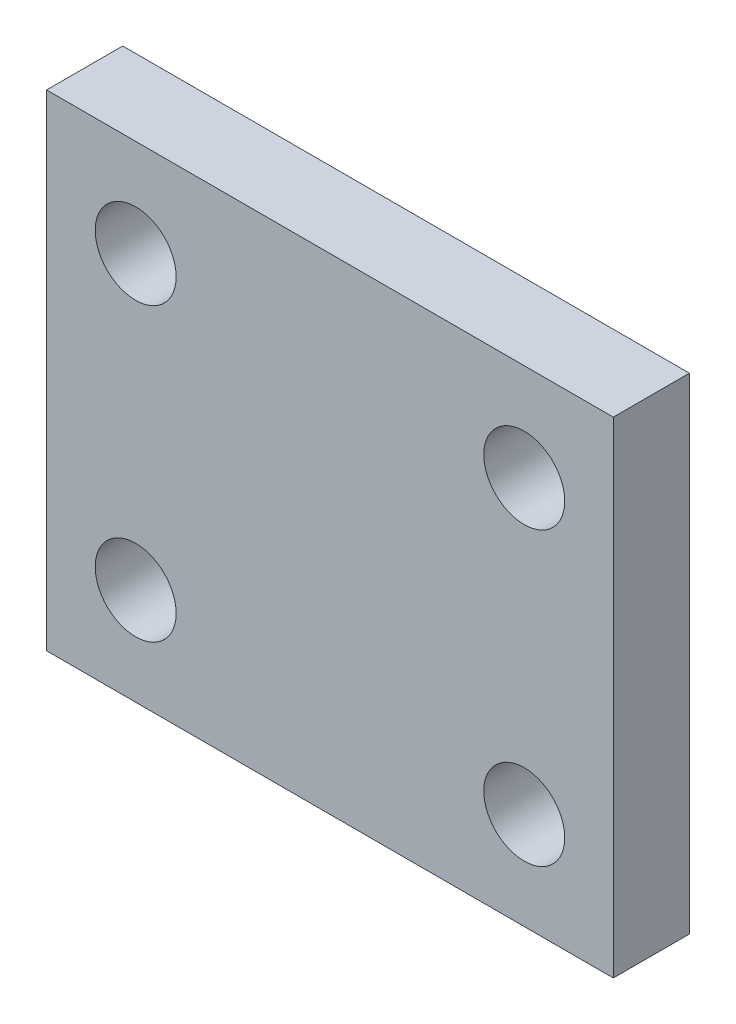
ISO-10303-21;
HEADER;
FILE_DESCRIPTION(('STEP AP214'),'2;1');
FILE_NAME('part.step','',(''),(''),'','','');
FILE_SCHEMA(('AUTOMOTIVE_DESIGN { 1 0 10303 214 1 1 1 1 }'));
ENDSEC;
DATA;
#1=APPLICATION_CONTEXT('core data for automotive mechanical design processes');
#2=APPLICATION_PROTOCOL_DEFINITION('international standard','automotive_design',2000,#1);
#3=PRODUCT_CONTEXT('',#1,'mechanical');
#4=PRODUCT('Part','Part','',(#3));
#5=PRODUCT_RELATED_PRODUCT_CATEGORY('part','',(#4));
#6=PRODUCT_DEFINITION_FORMATION('','',#4);
#7=PRODUCT_DEFINITION_CONTEXT('part definition',#1,'design');
#8=PRODUCT_DEFINITION('design','',#6,#7);
#9=PRODUCT_DEFINITION_SHAPE('','',#8);
#10=(LENGTH_UNIT() NAMED_UNIT(*) SI_UNIT(.MILLI.,.METRE.));
#11=(NAMED_UNIT(*) PLANE_ANGLE_UNIT() SI_UNIT($,.RADIAN.));
#12=(NAMED_UNIT(*) SI_UNIT($,.STERADIAN.) SOLID_ANGLE_UNIT());
#13=UNCERTAINTY_MEASURE_WITH_UNIT(LENGTH_MEASURE(1.E-05),#10,'distance_accuracy_value','');
#14=(GEOMETRIC_REPRESENTATION_CONTEXT(3) GLOBAL_UNCERTAINTY_ASSIGNED_CONTEXT((#13)) GLOBAL_UNIT_ASSIGNED_CONTEXT((#10,
#11,#12)) REPRESENTATION_CONTEXT('',''));
#15=CARTESIAN_POINT('',(0.,0.,0.));
#16=DIRECTION('',(0.,0.,1.));
#17=DIRECTION('',(1.,0.,0.));
#18=AXIS2_PLACEMENT_3D('',#15,#16,#17);
#19=CARTESIAN_POINT('',(0.,0.,4.7));
#20=DIRECTION('',(0.,0.,-1.));
#21=DIRECTION('',(-1.,0.,0.));
#22=AXIS2_PLACEMENT_3D('',#19,#20,#21);
#23=PLANE('',#22);
#24=DIRECTION('',(0.,-1.,0.));
#25=VECTOR('',#24,1.);
#26=CARTESIAN_POINT('',(0.,0.,4.7));
#27=LINE('',#26,#25);
#28=CARTESIAN_POINT('',(0.,30.,4.7));
#29=VERTEX_POINT('',#28);
#30=CARTESIAN_POINT('',(0.,0.,4.7));
#31=VERTEX_POINT('',#30);
#32=EDGE_CURVE('E94',#29,#31,#27,.T.);
#33=ORIENTED_EDGE('',*,*,#32,.T.);
#34=DIRECTION('',(1.,0.,0.));
#35=VECTOR('',#34,1.);
#36=CARTESIAN_POINT('',(0.,0.,4.7));
#37=LINE('',#36,#35);
#38=CARTESIAN_POINT('',(35.,0.,4.7));
#39=VERTEX_POINT('',#38);
#40=EDGE_CURVE('E89',#31,#39,#37,.T.);
#41=ORIENTED_EDGE('',*,*,#40,.T.);
#42=DIRECTION('',(0.,1.,0.));
#43=VECTOR('',#42,1.);
#44=CARTESIAN_POINT('',(35.,0.,4.7));
#45=LINE('',#44,#43);
#46=CARTESIAN_POINT('',(35.,30.,4.7));
#47=VERTEX_POINT('',#46);
#48=EDGE_CURVE('E92',#39,#47,#45,.T.);
#49=ORIENTED_EDGE('',*,*,#48,.T.);
#50=DIRECTION('',(-1.,0.,0.));
#51=VECTOR('',#50,1.);
#52=CARTESIAN_POINT('',(0.,30.,4.7));
#53=LINE('',#52,#51);
#54=EDGE_CURVE('E59',#47,#29,#53,.T.);
#55=ORIENTED_EDGE('',*,*,#54,.T.);
#56=EDGE_LOOP('',(#33,#41,#49,#55));
#57=FACE_BOUND('',#56,.T.);
#58=CARTESIAN_POINT('',(5.5,24.,4.7));
#59=DIRECTION('',(0.,0.,1.));
#60=DIRECTION('',(1.,0.,0.));
#61=AXIS2_PLACEMENT_3D('',#58,#59,#60);
#62=CIRCLE('',#61,2.5);
#63=CARTESIAN_POINT('',(8.,24.,4.7));
#64=VERTEX_POINT('',#63);
#65=EDGE_CURVE('E114',#64,#64,#62,.T.);
#66=ORIENTED_EDGE('',*,*,#65,.F.);
#67=EDGE_LOOP('',(#66));
#68=FACE_BOUND('',#67,.T.);
#69=CARTESIAN_POINT('',(29.5,24.,4.7));
#70=DIRECTION('',(0.,0.,1.));
#71=DIRECTION('',(1.,0.,0.));
#72=AXIS2_PLACEMENT_3D('',#69,#70,#71);
#73=CIRCLE('',#72,2.5);
#74=CARTESIAN_POINT('',(32.,24.,4.7));
#75=VERTEX_POINT('',#74);
#76=EDGE_CURVE('E136',#75,#75,#73,.T.);
#77=ORIENTED_EDGE('',*,*,#76,.F.);
#78=EDGE_LOOP('',(#77));
#79=FACE_BOUND('',#78,.T.);
#80=CARTESIAN_POINT('',(5.5,6.,4.7));
#81=DIRECTION('',(0.,0.,1.));
#82=DIRECTION('',(1.,0.,0.));
#83=AXIS2_PLACEMENT_3D('',#80,#81,#82);
#84=CIRCLE('',#83,2.5);
#85=CARTESIAN_POINT('',(8.,6.,4.7));
#86=VERTEX_POINT('',#85);
#87=EDGE_CURVE('E144',#86,#86,#84,.T.);
#88=ORIENTED_EDGE('',*,*,#87,.F.);
#89=EDGE_LOOP('',(#88));
#90=FACE_BOUND('',#89,.T.);
#91=CARTESIAN_POINT('',(29.5,6.,4.7));
#92=DIRECTION('',(0.,0.,1.));
#93=DIRECTION('',(1.,0.,0.));
#94=AXIS2_PLACEMENT_3D('',#91,#92,#93);
#95=CIRCLE('',#94,2.5);
#96=CARTESIAN_POINT('',(32.,6.,4.7));
#97=VERTEX_POINT('',#96);
#98=EDGE_CURVE('E152',#97,#97,#95,.T.);
#99=ORIENTED_EDGE('',*,*,#98,.F.);
#100=EDGE_LOOP('',(#99));
#101=FACE_BOUND('',#100,.T.);
#102=ADVANCED_FACE('F41',(#57,#68,#79,#90,#101),#23,.F.);
#103=CARTESIAN_POINT('',(0.,0.,0.));
#104=DIRECTION('',(0.,0.,-1.));
#105=DIRECTION('',(-1.,0.,0.));
#106=AXIS2_PLACEMENT_3D('',#103,#104,#105);
#107=PLANE('',#106);
#108=CARTESIAN_POINT('',(5.5,6.,0.));
#109=DIRECTION('',(0.,0.,1.));
#110=DIRECTION('',(1.,0.,0.));
#111=AXIS2_PLACEMENT_3D('',#108,#109,#110);
#112=CIRCLE('',#111,2.5);
#113=CARTESIAN_POINT('',(8.,6.,0.));
#114=VERTEX_POINT('',#113);
#115=EDGE_CURVE('E148',#114,#114,#112,.T.);
#116=ORIENTED_EDGE('',*,*,#115,.T.);
#117=EDGE_LOOP('',(#116));
#118=FACE_BOUND('',#117,.T.);
#119=CARTESIAN_POINT('',(5.5,24.,0.));
#120=DIRECTION('',(0.,0.,1.));
#121=DIRECTION('',(1.,0.,0.));
#122=AXIS2_PLACEMENT_3D('',#119,#120,#121);
#123=CIRCLE('',#122,2.5);
#124=CARTESIAN_POINT('',(8.,24.,0.));
#125=VERTEX_POINT('',#124);
#126=EDGE_CURVE('E132',#125,#125,#123,.T.);
#127=ORIENTED_EDGE('',*,*,#126,.T.);
#128=EDGE_LOOP('',(#127));
#129=FACE_BOUND('',#128,.T.);
#130=DIRECTION('',(0.,-1.,0.));
#131=VECTOR('',#130,1.);
#132=CARTESIAN_POINT('',(0.,0.,0.));
#133=LINE('',#132,#131);
#134=CARTESIAN_POINT('',(0.,30.,0.));
#135=VERTEX_POINT('',#134);
#136=CARTESIAN_POINT('',(0.,0.,0.));
#137=VERTEX_POINT('',#136);
#138=EDGE_CURVE('E110',#135,#137,#133,.T.);
#139=ORIENTED_EDGE('',*,*,#138,.F.);
#140=DIRECTION('',(-1.,0.,0.));
#141=VECTOR('',#140,1.);
#142=CARTESIAN_POINT('',(0.,30.,0.));
#143=LINE('',#142,#141);
#144=CARTESIAN_POINT('',(35.,30.,0.));
#145=VERTEX_POINT('',#144);
#146=EDGE_CURVE('E82',#145,#135,#143,.T.);
#147=ORIENTED_EDGE('',*,*,#146,.F.);
#148=DIRECTION('',(0.,1.,0.));
#149=VECTOR('',#148,1.);
#150=CARTESIAN_POINT('',(35.,0.,0.));
#151=LINE('',#150,#149);
#152=CARTESIAN_POINT('',(35.,0.,0.));
#153=VERTEX_POINT('',#152);
#154=EDGE_CURVE('E76',#153,#145,#151,.T.);
#155=ORIENTED_EDGE('',*,*,#154,.F.);
#156=DIRECTION('',(1.,0.,0.));
#157=VECTOR('',#156,1.);
#158=CARTESIAN_POINT('',(0.,0.,0.));
#159=LINE('',#158,#157);
#160=EDGE_CURVE('E99',#137,#153,#159,.T.);
#161=ORIENTED_EDGE('',*,*,#160,.F.);
#162=EDGE_LOOP('',(#139,#147,#155,#161));
#163=FACE_BOUND('',#162,.T.);
#164=CARTESIAN_POINT('',(29.5,24.,0.));
#165=DIRECTION('',(0.,0.,1.));
#166=DIRECTION('',(1.,0.,0.));
#167=AXIS2_PLACEMENT_3D('',#164,#165,#166);
#168=CIRCLE('',#167,2.5);
#169=CARTESIAN_POINT('',(32.,24.,0.));
#170=VERTEX_POINT('',#169);
#171=EDGE_CURVE('E140',#170,#170,#168,.T.);
#172=ORIENTED_EDGE('',*,*,#171,.T.);
#173=EDGE_LOOP('',(#172));
#174=FACE_BOUND('',#173,.T.);
#175=CARTESIAN_POINT('',(29.5,6.,0.));
#176=DIRECTION('',(0.,0.,1.));
#177=DIRECTION('',(1.,0.,0.));
#178=AXIS2_PLACEMENT_3D('',#175,#176,#177);
#179=CIRCLE('',#178,2.5);
#180=CARTESIAN_POINT('',(32.,6.,0.));
#181=VERTEX_POINT('',#180);
#182=EDGE_CURVE('E156',#181,#181,#179,.T.);
#183=ORIENTED_EDGE('',*,*,#182,.T.);
#184=EDGE_LOOP('',(#183));
#185=FACE_BOUND('',#184,.T.);
#186=ADVANCED_FACE('F127',(#118,#129,#163,#174,#185),#107,.T.);
#187=CARTESIAN_POINT('',(0.,0.,4.7));
#188=DIRECTION('',(1.,0.,0.));
#189=DIRECTION('',(0.,0.,-1.));
#190=AXIS2_PLACEMENT_3D('',#187,#188,#189);
#191=PLANE('',#190);
#192=ORIENTED_EDGE('',*,*,#138,.T.);
#193=DIRECTION('',(0.,0.,-1.));
#194=VECTOR('',#193,1.);
#195=CARTESIAN_POINT('',(0.,0.,4.7));
#196=LINE('',#195,#194);
#197=EDGE_CURVE('E11',#31,#137,#196,.T.);
#198=ORIENTED_EDGE('',*,*,#197,.F.);
#199=ORIENTED_EDGE('',*,*,#32,.F.);
#200=DIRECTION('',(0.,0.,-1.));
#201=VECTOR('',#200,1.);
#202=CARTESIAN_POINT('',(0.,30.,4.7));
#203=LINE('',#202,#201);
#204=EDGE_CURVE('E106',#29,#135,#203,.T.);
#205=ORIENTED_EDGE('',*,*,#204,.T.);
#206=EDGE_LOOP('',(#192,#198,#199,#205));
#207=FACE_BOUND('',#206,.T.);
#208=ADVANCED_FACE('F43',(#207),#191,.F.);
#209=CARTESIAN_POINT('',(0.,0.,4.7));
#210=DIRECTION('',(0.,1.,0.));
#211=DIRECTION('',(0.,0.,1.));
#212=AXIS2_PLACEMENT_3D('',#209,#210,#211);
#213=PLANE('',#212);
#214=ORIENTED_EDGE('',*,*,#160,.T.);
#215=DIRECTION('',(0.,0.,-1.));
#216=VECTOR('',#215,1.);
#217=CARTESIAN_POINT('',(35.,0.,4.7));
#218=LINE('',#217,#216);
#219=EDGE_CURVE('E51',#39,#153,#218,.T.);
#220=ORIENTED_EDGE('',*,*,#219,.F.);
#221=ORIENTED_EDGE('',*,*,#40,.F.);
#222=ORIENTED_EDGE('',*,*,#197,.T.);
#223=EDGE_LOOP('',(#214,#220,#221,#222));
#224=FACE_BOUND('',#223,.T.);
#225=ADVANCED_FACE('F98',(#224),#213,.F.);
#226=CARTESIAN_POINT('',(35.,0.,4.7));
#227=DIRECTION('',(-1.,0.,0.));
#228=DIRECTION('',(0.,0.,1.));
#229=AXIS2_PLACEMENT_3D('',#226,#227,#228);
#230=PLANE('',#229);
#231=ORIENTED_EDGE('',*,*,#154,.T.);
#232=DIRECTION('',(0.,0.,-1.));
#233=VECTOR('',#232,1.);
#234=CARTESIAN_POINT('',(35.,30.,4.7));
#235=LINE('',#234,#233);
#236=EDGE_CURVE('E101',#47,#145,#235,.T.);
#237=ORIENTED_EDGE('',*,*,#236,.F.);
#238=ORIENTED_EDGE('',*,*,#48,.F.);
#239=ORIENTED_EDGE('',*,*,#219,.T.);
#240=EDGE_LOOP('',(#231,#237,#238,#239));
#241=FACE_BOUND('',#240,.T.);
#242=ADVANCED_FACE('F102',(#241),#230,.F.);
#243=CARTESIAN_POINT('',(0.,30.,4.7));
#244=DIRECTION('',(0.,-1.,0.));
#245=DIRECTION('',(0.,0.,-1.));
#246=AXIS2_PLACEMENT_3D('',#243,#244,#245);
#247=PLANE('',#246);
#248=ORIENTED_EDGE('',*,*,#146,.T.);
#249=ORIENTED_EDGE('',*,*,#204,.F.);
#250=ORIENTED_EDGE('',*,*,#54,.F.);
#251=ORIENTED_EDGE('',*,*,#236,.T.);
#252=EDGE_LOOP('',(#248,#249,#250,#251));
#253=FACE_BOUND('',#252,.T.);
#254=ADVANCED_FACE('F124',(#253),#247,.F.);
#255=CARTESIAN_POINT('',(5.5,24.,4.7));
#256=DIRECTION('',(0.,0.,-1.));
#257=DIRECTION('',(-1.,0.,0.));
#258=AXIS2_PLACEMENT_3D('',#255,#256,#257);
#259=CYLINDRICAL_SURFACE('',#258,2.5);
#260=ORIENTED_EDGE('',*,*,#65,.T.);
#261=EDGE_LOOP('',(#260));
#262=FACE_BOUND('',#261,.T.);
#263=ORIENTED_EDGE('',*,*,#126,.F.);
#264=EDGE_LOOP('',(#263));
#265=FACE_BOUND('',#264,.T.);
#266=ADVANCED_FACE('F175',(#262,#265),#259,.F.);
#267=CARTESIAN_POINT('',(29.5,24.,4.7));
#268=DIRECTION('',(0.,0.,-1.));
#269=DIRECTION('',(-1.,0.,0.));
#270=AXIS2_PLACEMENT_3D('',#267,#268,#269);
#271=CYLINDRICAL_SURFACE('',#270,2.5);
#272=ORIENTED_EDGE('',*,*,#76,.T.);
#273=EDGE_LOOP('',(#272));
#274=FACE_BOUND('',#273,.T.);
#275=ORIENTED_EDGE('',*,*,#171,.F.);
#276=EDGE_LOOP('',(#275));
#277=FACE_BOUND('',#276,.T.);
#278=ADVANCED_FACE('F221',(#274,#277),#271,.F.);
#279=CARTESIAN_POINT('',(5.5,6.,4.7));
#280=DIRECTION('',(0.,0.,-1.));
#281=DIRECTION('',(-1.,0.,0.));
#282=AXIS2_PLACEMENT_3D('',#279,#280,#281);
#283=CYLINDRICAL_SURFACE('',#282,2.5);
#284=ORIENTED_EDGE('',*,*,#87,.T.);
#285=EDGE_LOOP('',(#284));
#286=FACE_BOUND('',#285,.T.);
#287=ORIENTED_EDGE('',*,*,#115,.F.);
#288=EDGE_LOOP('',(#287));
#289=FACE_BOUND('',#288,.T.);
#290=ADVANCED_FACE('F229',(#286,#289),#283,.F.);
#291=CARTESIAN_POINT('',(29.5,6.,4.7));
#292=DIRECTION('',(0.,0.,-1.));
#293=DIRECTION('',(-1.,0.,0.));
#294=AXIS2_PLACEMENT_3D('',#291,#292,#293);
#295=CYLINDRICAL_SURFACE('',#294,2.5);
#296=ORIENTED_EDGE('',*,*,#98,.T.);
#297=EDGE_LOOP('',(#296));
#298=FACE_BOUND('',#297,.T.);
#299=ORIENTED_EDGE('',*,*,#182,.F.);
#300=EDGE_LOOP('',(#299));
#301=FACE_BOUND('',#300,.T.);
#302=ADVANCED_FACE('F164',(#298,#301),#295,.F.);
#303=CLOSED_SHELL('',(#102,#186,#208,#225,#242,#254,#266,#278,#290,#302));
#304=MANIFOLD_SOLID_BREP('B2',#303);
#305=ADVANCED_BREP_SHAPE_REPRESENTATION('',(#18,#304),#14);
#306=SHAPE_DEFINITION_REPRESENTATION(#9,#305);
ENDSEC;
END-ISO-10303-21;
